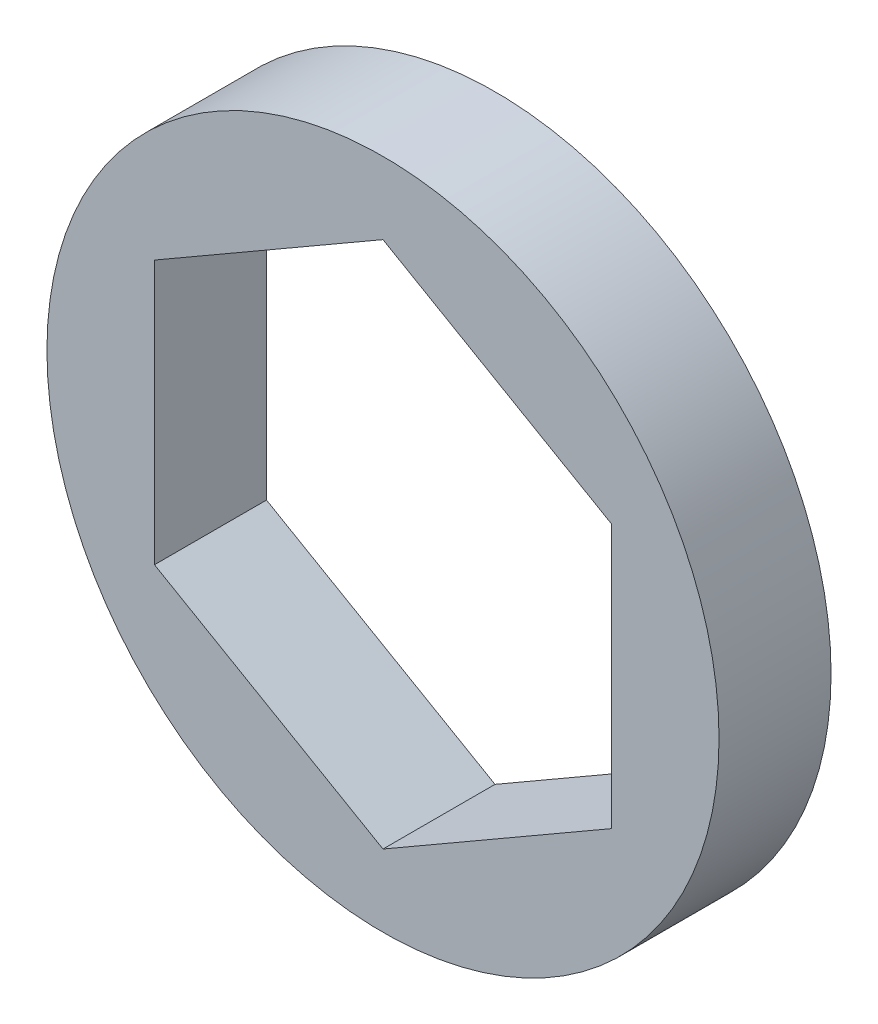
ISO-10303-21;
HEADER;
FILE_DESCRIPTION(('STEP AP214'),'2;1');
FILE_NAME('part.step','',(''),(''),'','','');
FILE_SCHEMA(('AUTOMOTIVE_DESIGN { 1 0 10303 214 1 1 1 1 }'));
ENDSEC;
DATA;
#1=APPLICATION_CONTEXT('core data for automotive mechanical design processes');
#2=APPLICATION_PROTOCOL_DEFINITION('international standard','automotive_design',2000,#1);
#3=PRODUCT_CONTEXT('',#1,'mechanical');
#4=PRODUCT('Part','Part','',(#3));
#5=PRODUCT_RELATED_PRODUCT_CATEGORY('part','',(#4));
#6=PRODUCT_DEFINITION_FORMATION('','',#4);
#7=PRODUCT_DEFINITION_CONTEXT('part definition',#1,'design');
#8=PRODUCT_DEFINITION('design','',#6,#7);
#9=PRODUCT_DEFINITION_SHAPE('','',#8);
#10=(LENGTH_UNIT() NAMED_UNIT(*) SI_UNIT(.MILLI.,.METRE.));
#11=(NAMED_UNIT(*) PLANE_ANGLE_UNIT() SI_UNIT($,.RADIAN.));
#12=(NAMED_UNIT(*) SI_UNIT($,.STERADIAN.) SOLID_ANGLE_UNIT());
#13=UNCERTAINTY_MEASURE_WITH_UNIT(LENGTH_MEASURE(1.E-05),#10,'distance_accuracy_value','');
#14=(GEOMETRIC_REPRESENTATION_CONTEXT(3) GLOBAL_UNCERTAINTY_ASSIGNED_CONTEXT((#13)) GLOBAL_UNIT_ASSIGNED_CONTEXT((#10,
#11,#12)) REPRESENTATION_CONTEXT('',''));
#15=CARTESIAN_POINT('',(0.,0.,0.));
#16=DIRECTION('',(0.,0.,1.));
#17=DIRECTION('',(1.,0.,0.));
#18=AXIS2_PLACEMENT_3D('',#15,#16,#17);
#19=CARTESIAN_POINT('',(0.,0.,1.5875));
#20=DIRECTION('',(0.,0.,-1.));
#21=DIRECTION('',(-1.,0.,0.));
#22=AXIS2_PLACEMENT_3D('',#19,#20,#21);
#23=CYLINDRICAL_SURFACE('',#22,9.525);
#24=CARTESIAN_POINT('',(0.,0.,1.5875));
#25=DIRECTION('',(0.,0.,-1.));
#26=DIRECTION('',(1.,0.,0.));
#27=AXIS2_PLACEMENT_3D('',#24,#25,#26);
#28=CIRCLE('',#27,9.525);
#29=CARTESIAN_POINT('',(9.525,0.,1.5875));
#30=VERTEX_POINT('',#29);
#31=EDGE_CURVE('E11',#30,#30,#28,.T.);
#32=ORIENTED_EDGE('',*,*,#31,.T.);
#33=EDGE_LOOP('',(#32));
#34=FACE_BOUND('',#33,.T.);
#35=CARTESIAN_POINT('',(0.,0.,-1.5875));
#36=DIRECTION('',(0.,0.,-1.));
#37=DIRECTION('',(1.,0.,0.));
#38=AXIS2_PLACEMENT_3D('',#35,#36,#37);
#39=CIRCLE('',#38,9.525);
#40=CARTESIAN_POINT('',(9.525,0.,-1.5875));
#41=VERTEX_POINT('',#40);
#42=EDGE_CURVE('E36',#41,#41,#39,.T.);
#43=ORIENTED_EDGE('',*,*,#42,.F.);
#44=EDGE_LOOP('',(#43));
#45=FACE_BOUND('',#44,.T.);
#46=ADVANCED_FACE('F33',(#34,#45),#23,.T.);
#47=CARTESIAN_POINT('',(0.,0.,1.5875));
#48=DIRECTION('',(0.,0.,1.));
#49=DIRECTION('',(1.,0.,0.));
#50=AXIS2_PLACEMENT_3D('',#47,#48,#49);
#51=PLANE('',#50);
#52=DIRECTION('',(0.866025403784439,0.5,0.));
#53=VECTOR('',#52,1.);
#54=CARTESIAN_POINT('',(0.,7.47899538708242,1.5875));
#55=LINE('',#54,#53);
#56=CARTESIAN_POINT('',(-6.47700000000001,3.73949769354121,1.5875));
#57=VERTEX_POINT('',#56);
#58=CARTESIAN_POINT('',(0.,7.47899538708242,1.5875));
#59=VERTEX_POINT('',#58);
#60=EDGE_CURVE('E87',#57,#59,#55,.T.);
#61=ORIENTED_EDGE('',*,*,#60,.T.);
#62=DIRECTION('',(0.866025403784438,-0.5,0.));
#63=VECTOR('',#62,1.);
#64=CARTESIAN_POINT('',(6.47700000000001,3.73949769354121,1.5875));
#65=LINE('',#64,#63);
#66=CARTESIAN_POINT('',(6.47700000000001,3.73949769354121,1.5875));
#67=VERTEX_POINT('',#66);
#68=EDGE_CURVE('E96',#59,#67,#65,.T.);
#69=ORIENTED_EDGE('',*,*,#68,.T.);
#70=DIRECTION('',(0.,-1.,0.));
#71=VECTOR('',#70,1.);
#72=CARTESIAN_POINT('',(6.47700000000001,-3.73949769354122,1.5875));
#73=LINE('',#72,#71);
#74=CARTESIAN_POINT('',(6.47700000000001,-3.73949769354122,1.5875));
#75=VERTEX_POINT('',#74);
#76=EDGE_CURVE('E47',#67,#75,#73,.T.);
#77=ORIENTED_EDGE('',*,*,#76,.T.);
#78=DIRECTION('',(-0.866025403784439,-0.5,0.));
#79=VECTOR('',#78,1.);
#80=CARTESIAN_POINT('',(0.,-7.47899538708242,1.5875));
#81=LINE('',#80,#79);
#82=CARTESIAN_POINT('',(0.,-7.47899538708242,1.5875));
#83=VERTEX_POINT('',#82);
#84=EDGE_CURVE('E111',#75,#83,#81,.T.);
#85=ORIENTED_EDGE('',*,*,#84,.T.);
#86=DIRECTION('',(-0.866025403784439,0.5,0.));
#87=VECTOR('',#86,1.);
#88=CARTESIAN_POINT('',(-6.47700000000001,-3.73949769354121,1.5875));
#89=LINE('',#88,#87);
#90=CARTESIAN_POINT('',(-6.47700000000001,-3.73949769354121,1.5875));
#91=VERTEX_POINT('',#90);
#92=EDGE_CURVE('E114',#83,#91,#89,.T.);
#93=ORIENTED_EDGE('',*,*,#92,.T.);
#94=DIRECTION('',(0.,1.,0.));
#95=VECTOR('',#94,1.);
#96=CARTESIAN_POINT('',(-6.47700000000001,3.73949769354121,1.5875));
#97=LINE('',#96,#95);
#98=EDGE_CURVE('E93',#91,#57,#97,.T.);
#99=ORIENTED_EDGE('',*,*,#98,.T.);
#100=EDGE_LOOP('',(#61,#69,#77,#85,#93,#99));
#101=FACE_BOUND('',#100,.T.);
#102=ORIENTED_EDGE('',*,*,#31,.F.);
#103=EDGE_LOOP('',(#102));
#104=FACE_BOUND('',#103,.T.);
#105=ADVANCED_FACE('F100',(#101,#104),#51,.T.);
#106=CARTESIAN_POINT('',(0.,0.,-1.5875));
#107=DIRECTION('',(0.,0.,1.));
#108=DIRECTION('',(1.,0.,0.));
#109=AXIS2_PLACEMENT_3D('',#106,#107,#108);
#110=PLANE('',#109);
#111=DIRECTION('',(0.866025403784438,-0.5,0.));
#112=VECTOR('',#111,1.);
#113=CARTESIAN_POINT('',(6.47700000000001,3.73949769354121,-1.5875));
#114=LINE('',#113,#112);
#115=CARTESIAN_POINT('',(0.,7.47899538708242,-1.5875));
#116=VERTEX_POINT('',#115);
#117=CARTESIAN_POINT('',(6.47700000000001,3.73949769354121,-1.5875));
#118=VERTEX_POINT('',#117);
#119=EDGE_CURVE('E118',#116,#118,#114,.T.);
#120=ORIENTED_EDGE('',*,*,#119,.F.);
#121=DIRECTION('',(0.866025403784439,0.5,0.));
#122=VECTOR('',#121,1.);
#123=CARTESIAN_POINT('',(0.,7.47899538708242,-1.5875));
#124=LINE('',#123,#122);
#125=CARTESIAN_POINT('',(-6.47700000000001,3.73949769354121,-1.5875));
#126=VERTEX_POINT('',#125);
#127=EDGE_CURVE('E55',#126,#116,#124,.T.);
#128=ORIENTED_EDGE('',*,*,#127,.F.);
#129=DIRECTION('',(0.,1.,0.));
#130=VECTOR('',#129,1.);
#131=CARTESIAN_POINT('',(-6.47700000000001,3.73949769354121,-1.5875));
#132=LINE('',#131,#130);
#133=CARTESIAN_POINT('',(-6.47700000000001,-3.73949769354121,-1.5875));
#134=VERTEX_POINT('',#133);
#135=EDGE_CURVE('E104',#134,#126,#132,.T.);
#136=ORIENTED_EDGE('',*,*,#135,.F.);
#137=DIRECTION('',(-0.866025403784439,0.5,0.));
#138=VECTOR('',#137,1.);
#139=CARTESIAN_POINT('',(-6.47700000000001,-3.73949769354121,-1.5875));
#140=LINE('',#139,#138);
#141=CARTESIAN_POINT('',(0.,-7.47899538708242,-1.5875));
#142=VERTEX_POINT('',#141);
#143=EDGE_CURVE('E107',#142,#134,#140,.T.);
#144=ORIENTED_EDGE('',*,*,#143,.F.);
#145=DIRECTION('',(-0.866025403784439,-0.5,0.));
#146=VECTOR('',#145,1.);
#147=CARTESIAN_POINT('',(0.,-7.47899538708242,-1.5875));
#148=LINE('',#147,#146);
#149=CARTESIAN_POINT('',(6.47700000000001,-3.73949769354122,-1.5875));
#150=VERTEX_POINT('',#149);
#151=EDGE_CURVE('E123',#150,#142,#148,.T.);
#152=ORIENTED_EDGE('',*,*,#151,.F.);
#153=DIRECTION('',(0.,-1.,0.));
#154=VECTOR('',#153,1.);
#155=CARTESIAN_POINT('',(6.47700000000001,-3.73949769354122,-1.5875));
#156=LINE('',#155,#154);
#157=EDGE_CURVE('E120',#118,#150,#156,.T.);
#158=ORIENTED_EDGE('',*,*,#157,.F.);
#159=EDGE_LOOP('',(#120,#128,#136,#144,#152,#158));
#160=FACE_BOUND('',#159,.T.);
#161=ORIENTED_EDGE('',*,*,#42,.T.);
#162=EDGE_LOOP('',(#161));
#163=FACE_BOUND('',#162,.T.);
#164=ADVANCED_FACE('F140',(#160,#163),#110,.F.);
#165=CARTESIAN_POINT('',(0.,7.47899538708242,1.5875));
#166=DIRECTION('',(-0.5,0.866025403784439,0.));
#167=DIRECTION('',(-0.866025403784439,-0.5,0.));
#168=AXIS2_PLACEMENT_3D('',#165,#166,#167);
#169=PLANE('',#168);
#170=ORIENTED_EDGE('',*,*,#127,.T.);
#171=DIRECTION('',(0.,0.,-1.));
#172=VECTOR('',#171,1.);
#173=CARTESIAN_POINT('',(0.,7.47899538708242,1.5875));
#174=LINE('',#173,#172);
#175=EDGE_CURVE('E83',#59,#116,#174,.T.);
#176=ORIENTED_EDGE('',*,*,#175,.F.);
#177=ORIENTED_EDGE('',*,*,#60,.F.);
#178=DIRECTION('',(0.,0.,-1.));
#179=VECTOR('',#178,1.);
#180=CARTESIAN_POINT('',(-6.47700000000001,3.73949769354121,1.5875));
#181=LINE('',#180,#179);
#182=EDGE_CURVE('E128',#57,#126,#181,.T.);
#183=ORIENTED_EDGE('',*,*,#182,.T.);
#184=EDGE_LOOP('',(#170,#176,#177,#183));
#185=FACE_BOUND('',#184,.T.);
#186=ADVANCED_FACE('F85',(#185),#169,.F.);
#187=CARTESIAN_POINT('',(-6.47700000000001,3.73949769354121,1.5875));
#188=DIRECTION('',(-1.,0.,0.));
#189=DIRECTION('',(0.,-1.,0.));
#190=AXIS2_PLACEMENT_3D('',#187,#188,#189);
#191=PLANE('',#190);
#192=ORIENTED_EDGE('',*,*,#135,.T.);
#193=ORIENTED_EDGE('',*,*,#182,.F.);
#194=ORIENTED_EDGE('',*,*,#98,.F.);
#195=DIRECTION('',(0.,0.,-1.));
#196=VECTOR('',#195,1.);
#197=CARTESIAN_POINT('',(-6.47700000000001,-3.73949769354121,1.5875));
#198=LINE('',#197,#196);
#199=EDGE_CURVE('E130',#91,#134,#198,.T.);
#200=ORIENTED_EDGE('',*,*,#199,.T.);
#201=EDGE_LOOP('',(#192,#193,#194,#200));
#202=FACE_BOUND('',#201,.T.);
#203=ADVANCED_FACE('F151',(#202),#191,.F.);
#204=CARTESIAN_POINT('',(-6.47700000000001,-3.73949769354121,1.5875));
#205=DIRECTION('',(-0.5,-0.866025403784439,0.));
#206=DIRECTION('',(0.866025403784439,-0.5,0.));
#207=AXIS2_PLACEMENT_3D('',#204,#205,#206);
#208=PLANE('',#207);
#209=ORIENTED_EDGE('',*,*,#143,.T.);
#210=ORIENTED_EDGE('',*,*,#199,.F.);
#211=ORIENTED_EDGE('',*,*,#92,.F.);
#212=DIRECTION('',(0.,0.,-1.));
#213=VECTOR('',#212,1.);
#214=CARTESIAN_POINT('',(0.,-7.47899538708242,1.5875));
#215=LINE('',#214,#213);
#216=EDGE_CURVE('E132',#83,#142,#215,.T.);
#217=ORIENTED_EDGE('',*,*,#216,.T.);
#218=EDGE_LOOP('',(#209,#210,#211,#217));
#219=FACE_BOUND('',#218,.T.);
#220=ADVANCED_FACE('F149',(#219),#208,.F.);
#221=CARTESIAN_POINT('',(0.,-7.47899538708242,1.5875));
#222=DIRECTION('',(0.5,-0.866025403784439,0.));
#223=DIRECTION('',(0.866025403784439,0.5,0.));
#224=AXIS2_PLACEMENT_3D('',#221,#222,#223);
#225=PLANE('',#224);
#226=ORIENTED_EDGE('',*,*,#151,.T.);
#227=ORIENTED_EDGE('',*,*,#216,.F.);
#228=ORIENTED_EDGE('',*,*,#84,.F.);
#229=DIRECTION('',(0.,0.,-1.));
#230=VECTOR('',#229,1.);
#231=CARTESIAN_POINT('',(6.47700000000001,-3.73949769354122,1.5875));
#232=LINE('',#231,#230);
#233=EDGE_CURVE('E134',#75,#150,#232,.T.);
#234=ORIENTED_EDGE('',*,*,#233,.T.);
#235=EDGE_LOOP('',(#226,#227,#228,#234));
#236=FACE_BOUND('',#235,.T.);
#237=ADVANCED_FACE('F145',(#236),#225,.F.);
#238=CARTESIAN_POINT('',(6.47700000000001,-3.73949769354122,1.5875));
#239=DIRECTION('',(1.,0.,0.));
#240=DIRECTION('',(0.,0.,-1.));
#241=AXIS2_PLACEMENT_3D('',#238,#239,#240);
#242=PLANE('',#241);
#243=ORIENTED_EDGE('',*,*,#157,.T.);
#244=ORIENTED_EDGE('',*,*,#233,.F.);
#245=ORIENTED_EDGE('',*,*,#76,.F.);
#246=DIRECTION('',(0.,0.,-1.));
#247=VECTOR('',#246,1.);
#248=CARTESIAN_POINT('',(6.47700000000001,3.73949769354121,1.5875));
#249=LINE('',#248,#247);
#250=EDGE_CURVE('E92',#67,#118,#249,.T.);
#251=ORIENTED_EDGE('',*,*,#250,.T.);
#252=EDGE_LOOP('',(#243,#244,#245,#251));
#253=FACE_BOUND('',#252,.T.);
#254=ADVANCED_FACE('F136',(#253),#242,.F.);
#255=CARTESIAN_POINT('',(6.47700000000001,3.73949769354121,1.5875));
#256=DIRECTION('',(0.500000000000001,0.866025403784438,0.));
#257=DIRECTION('',(-0.866025403784438,0.500000000000001,0.));
#258=AXIS2_PLACEMENT_3D('',#255,#256,#257);
#259=PLANE('',#258);
#260=ORIENTED_EDGE('',*,*,#119,.T.);
#261=ORIENTED_EDGE('',*,*,#250,.F.);
#262=ORIENTED_EDGE('',*,*,#68,.F.);
#263=ORIENTED_EDGE('',*,*,#175,.T.);
#264=EDGE_LOOP('',(#260,#261,#262,#263));
#265=FACE_BOUND('',#264,.T.);
#266=ADVANCED_FACE('F97',(#265),#259,.F.);
#267=CLOSED_SHELL('',(#46,#105,#164,#186,#203,#220,#237,#254,#266));
#268=MANIFOLD_SOLID_BREP('B2',#267);
#269=ADVANCED_BREP_SHAPE_REPRESENTATION('',(#18,#268),#14);
#270=SHAPE_DEFINITION_REPRESENTATION(#9,#269);
ENDSEC;
END-ISO-10303-21;
